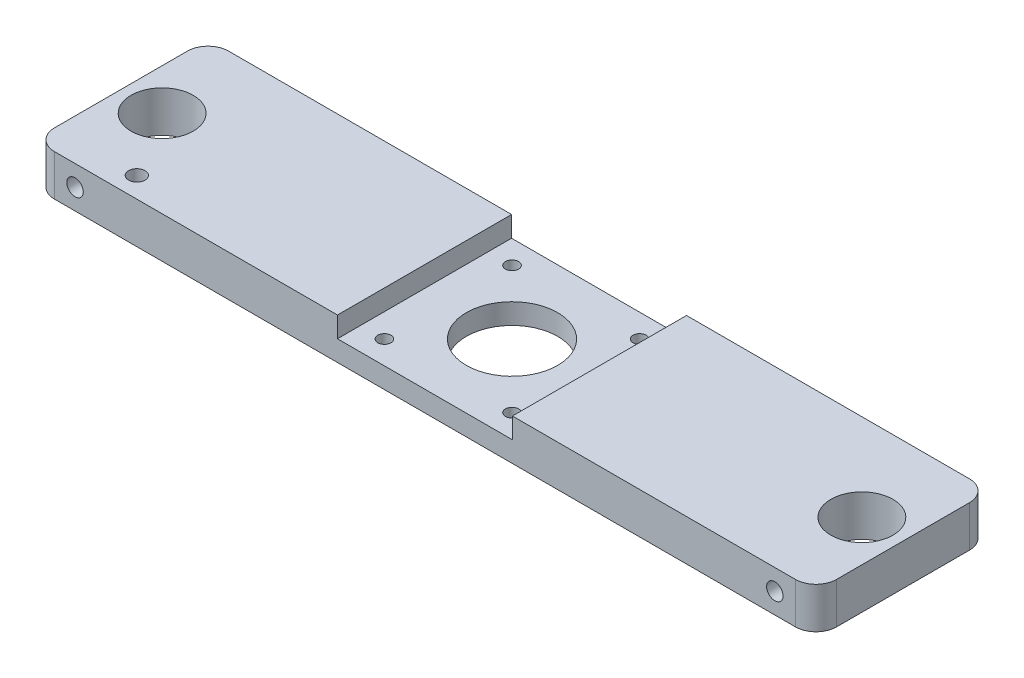
ISO-10303-21;
HEADER;
FILE_DESCRIPTION(('STEP AP214'),'2;1');
FILE_NAME('part.step','',(''),(''),'','','');
FILE_SCHEMA(('AUTOMOTIVE_DESIGN { 1 0 10303 214 1 1 1 1 }'));
ENDSEC;
DATA;
#1=APPLICATION_CONTEXT('core data for automotive mechanical design processes');
#2=APPLICATION_PROTOCOL_DEFINITION('international standard','automotive_design',2000,#1);
#3=PRODUCT_CONTEXT('',#1,'mechanical');
#4=PRODUCT('Part','Part','',(#3));
#5=PRODUCT_RELATED_PRODUCT_CATEGORY('part','',(#4));
#6=PRODUCT_DEFINITION_FORMATION('','',#4);
#7=PRODUCT_DEFINITION_CONTEXT('part definition',#1,'design');
#8=PRODUCT_DEFINITION('design','',#6,#7);
#9=PRODUCT_DEFINITION_SHAPE('','',#8);
#10=(LENGTH_UNIT() NAMED_UNIT(*) SI_UNIT(.MILLI.,.METRE.));
#11=(NAMED_UNIT(*) PLANE_ANGLE_UNIT() SI_UNIT($,.RADIAN.));
#12=(NAMED_UNIT(*) SI_UNIT($,.STERADIAN.) SOLID_ANGLE_UNIT());
#13=UNCERTAINTY_MEASURE_WITH_UNIT(LENGTH_MEASURE(1.E-05),#10,'distance_accuracy_value','');
#14=(GEOMETRIC_REPRESENTATION_CONTEXT(3) GLOBAL_UNCERTAINTY_ASSIGNED_CONTEXT((#13)) GLOBAL_UNIT_ASSIGNED_CONTEXT((#10,
#11,#12)) REPRESENTATION_CONTEXT('',''));
#15=CARTESIAN_POINT('',(0.,0.,0.));
#16=DIRECTION('',(0.,0.,1.));
#17=DIRECTION('',(1.,0.,0.));
#18=AXIS2_PLACEMENT_3D('',#15,#16,#17);
#19=CARTESIAN_POINT('',(0.,10.,0.));
#20=DIRECTION('',(0.,1.,0.));
#21=DIRECTION('',(0.,0.,1.));
#22=AXIS2_PLACEMENT_3D('',#19,#20,#21);
#23=PLANE('',#22);
#24=CARTESIAN_POINT('',(85.,10.,0.));
#25=DIRECTION('',(0.,1.,0.));
#26=DIRECTION('',(0.,0.,-1.));
#27=AXIS2_PLACEMENT_3D('',#24,#25,#26);
#28=CIRCLE('',#27,7.55);
#29=CARTESIAN_POINT('',(85.,10.,-7.55));
#30=VERTEX_POINT('',#29);
#31=EDGE_CURVE('E335',#30,#30,#28,.T.);
#32=ORIENTED_EDGE('',*,*,#31,.F.);
#33=EDGE_LOOP('',(#32));
#34=FACE_BOUND('',#33,.T.);
#35=DIRECTION('',(0.,0.,-1.));
#36=VECTOR('',#35,1.);
#37=CARTESIAN_POINT('',(95.,10.,-21.15));
#38=LINE('',#37,#36);
#39=CARTESIAN_POINT('',(95.,10.,16.15));
#40=VERTEX_POINT('',#39);
#41=CARTESIAN_POINT('',(95.,10.,-16.15));
#42=VERTEX_POINT('',#41);
#43=EDGE_CURVE('E178',#40,#42,#38,.T.);
#44=ORIENTED_EDGE('',*,*,#43,.T.);
#45=CARTESIAN_POINT('',(90.,10.,-16.15));
#46=DIRECTION('',(0.,1.,0.));
#47=DIRECTION('',(0.,0.,1.));
#48=AXIS2_PLACEMENT_3D('',#45,#46,#47);
#49=CIRCLE('',#48,5.);
#50=CARTESIAN_POINT('',(90.,10.,-21.15));
#51=VERTEX_POINT('',#50);
#52=EDGE_CURVE('E236',#42,#51,#49,.T.);
#53=ORIENTED_EDGE('',*,*,#52,.T.);
#54=DIRECTION('',(-1.,0.,0.));
#55=VECTOR('',#54,1.);
#56=CARTESIAN_POINT('',(-95.,10.,-21.15));
#57=LINE('',#56,#55);
#58=CARTESIAN_POINT('',(21.25,10.,-21.15));
#59=VERTEX_POINT('',#58);
#60=EDGE_CURVE('E184',#51,#59,#57,.T.);
#61=ORIENTED_EDGE('',*,*,#60,.T.);
#62=DIRECTION('',(0.,0.,-1.));
#63=VECTOR('',#62,1.);
#64=CARTESIAN_POINT('',(21.25,10.,0.));
#65=LINE('',#64,#63);
#66=CARTESIAN_POINT('',(21.25,10.,21.15));
#67=VERTEX_POINT('',#66);
#68=EDGE_CURVE('E150',#67,#59,#65,.T.);
#69=ORIENTED_EDGE('',*,*,#68,.F.);
#70=DIRECTION('',(1.,0.,0.));
#71=VECTOR('',#70,1.);
#72=CARTESIAN_POINT('',(-95.,10.,21.15));
#73=LINE('',#72,#71);
#74=CARTESIAN_POINT('',(90.,10.,21.15));
#75=VERTEX_POINT('',#74);
#76=EDGE_CURVE('E140',#67,#75,#73,.T.);
#77=ORIENTED_EDGE('',*,*,#76,.T.);
#78=CARTESIAN_POINT('',(90.,10.,16.15));
#79=DIRECTION('',(0.,1.,0.));
#80=DIRECTION('',(0.,0.,1.));
#81=AXIS2_PLACEMENT_3D('',#78,#79,#80);
#82=CIRCLE('',#81,5.);
#83=EDGE_CURVE('E233',#75,#40,#82,.T.);
#84=ORIENTED_EDGE('',*,*,#83,.T.);
#85=EDGE_LOOP('',(#44,#53,#61,#69,#77,#84));
#86=FACE_BOUND('',#85,.T.);
#87=ADVANCED_FACE('F40',(#34,#86),#23,.T.);
#88=CARTESIAN_POINT('',(95.,10.,-21.15));
#89=DIRECTION('',(-1.,0.,0.));
#90=DIRECTION('',(0.,0.,1.));
#91=AXIS2_PLACEMENT_3D('',#88,#89,#90);
#92=PLANE('',#91);
#93=DIRECTION('',(0.,0.,-1.));
#94=VECTOR('',#93,1.);
#95=CARTESIAN_POINT('',(95.,0.,-21.15));
#96=LINE('',#95,#94);
#97=CARTESIAN_POINT('',(95.,0.,16.15));
#98=VERTEX_POINT('',#97);
#99=CARTESIAN_POINT('',(95.,0.,-16.15));
#100=VERTEX_POINT('',#99);
#101=EDGE_CURVE('E177',#98,#100,#96,.T.);
#102=ORIENTED_EDGE('',*,*,#101,.T.);
#103=DIRECTION('',(0.,-1.,0.));
#104=VECTOR('',#103,1.);
#105=CARTESIAN_POINT('',(95.,10.,-16.15));
#106=LINE('',#105,#104);
#107=EDGE_CURVE('E230',#100,#42,#106,.F.);
#108=ORIENTED_EDGE('',*,*,#107,.T.);
#109=ORIENTED_EDGE('',*,*,#43,.F.);
#110=DIRECTION('',(0.,-1.,0.));
#111=VECTOR('',#110,1.);
#112=CARTESIAN_POINT('',(95.,10.,16.15));
#113=LINE('',#112,#111);
#114=EDGE_CURVE('E226',#40,#98,#113,.T.);
#115=ORIENTED_EDGE('',*,*,#114,.T.);
#116=EDGE_LOOP('',(#102,#108,#109,#115));
#117=FACE_BOUND('',#116,.T.);
#118=ADVANCED_FACE('F277',(#117),#92,.F.);
#119=CARTESIAN_POINT('',(-95.,10.,-21.15));
#120=DIRECTION('',(0.,0.,1.));
#121=DIRECTION('',(1.,0.,0.));
#122=AXIS2_PLACEMENT_3D('',#119,#120,#121);
#123=PLANE('',#122);
#124=ORIENTED_EDGE('',*,*,#60,.F.);
#125=DIRECTION('',(0.,-1.,0.));
#126=VECTOR('',#125,1.);
#127=CARTESIAN_POINT('',(90.,10.,-21.15));
#128=LINE('',#127,#126);
#129=CARTESIAN_POINT('',(90.,0.,-21.15));
#130=VERTEX_POINT('',#129);
#131=EDGE_CURVE('E210',#51,#130,#128,.T.);
#132=ORIENTED_EDGE('',*,*,#131,.T.);
#133=DIRECTION('',(-1.,0.,0.));
#134=VECTOR('',#133,1.);
#135=CARTESIAN_POINT('',(-95.,0.,-21.15));
#136=LINE('',#135,#134);
#137=CARTESIAN_POINT('',(-90.,0.,-21.15));
#138=VERTEX_POINT('',#137);
#139=EDGE_CURVE('E193',#130,#138,#136,.T.);
#140=ORIENTED_EDGE('',*,*,#139,.T.);
#141=DIRECTION('',(0.,-1.,0.));
#142=VECTOR('',#141,1.);
#143=CARTESIAN_POINT('',(-90.,10.,-21.15));
#144=LINE('',#143,#142);
#145=CARTESIAN_POINT('',(-90.,10.,-21.15));
#146=VERTEX_POINT('',#145);
#147=EDGE_CURVE('E207',#138,#146,#144,.F.);
#148=ORIENTED_EDGE('',*,*,#147,.T.);
#149=CARTESIAN_POINT('',(-21.25,10.,-21.15));
#150=VERTEX_POINT('',#149);
#151=EDGE_CURVE('E182',#150,#146,#57,.T.);
#152=ORIENTED_EDGE('',*,*,#151,.F.);
#153=DIRECTION('',(0.,-1.,0.));
#154=VECTOR('',#153,1.);
#155=CARTESIAN_POINT('',(-21.25,10.,-21.15));
#156=LINE('',#155,#154);
#157=CARTESIAN_POINT('',(-21.25,5.,-21.15));
#158=VERTEX_POINT('',#157);
#159=EDGE_CURVE('E148',#150,#158,#156,.T.);
#160=ORIENTED_EDGE('',*,*,#159,.T.);
#161=DIRECTION('',(-1.,0.,0.));
#162=VECTOR('',#161,1.);
#163=CARTESIAN_POINT('',(-95.,5.,-21.15));
#164=LINE('',#163,#162);
#165=CARTESIAN_POINT('',(21.25,5.,-21.15));
#166=VERTEX_POINT('',#165);
#167=EDGE_CURVE('E174',#166,#158,#164,.T.);
#168=ORIENTED_EDGE('',*,*,#167,.F.);
#169=DIRECTION('',(0.,1.,0.));
#170=VECTOR('',#169,1.);
#171=CARTESIAN_POINT('',(21.25,10.,-21.15));
#172=LINE('',#171,#170);
#173=EDGE_CURVE('E170',#166,#59,#172,.T.);
#174=ORIENTED_EDGE('',*,*,#173,.T.);
#175=EDGE_LOOP('',(#124,#132,#140,#148,#152,#160,#168,#174));
#176=FACE_BOUND('',#175,.T.);
#177=ADVANCED_FACE('F284',(#176),#123,.F.);
#178=CARTESIAN_POINT('',(-95.,10.,-21.15));
#179=DIRECTION('',(1.,0.,0.));
#180=DIRECTION('',(0.,0.,-1.));
#181=AXIS2_PLACEMENT_3D('',#178,#179,#180);
#182=PLANE('',#181);
#183=DIRECTION('',(0.,0.,1.));
#184=VECTOR('',#183,1.);
#185=CARTESIAN_POINT('',(-95.,0.,-21.15));
#186=LINE('',#185,#184);
#187=CARTESIAN_POINT('',(-95.,0.,-16.15));
#188=VERTEX_POINT('',#187);
#189=CARTESIAN_POINT('',(-95.,0.,16.15));
#190=VERTEX_POINT('',#189);
#191=EDGE_CURVE('E197',#188,#190,#186,.T.);
#192=ORIENTED_EDGE('',*,*,#191,.T.);
#193=DIRECTION('',(0.,-1.,0.));
#194=VECTOR('',#193,1.);
#195=CARTESIAN_POINT('',(-95.,10.,16.15));
#196=LINE('',#195,#194);
#197=CARTESIAN_POINT('',(-95.,10.,16.15));
#198=VERTEX_POINT('',#197);
#199=EDGE_CURVE('E56',#190,#198,#196,.F.);
#200=ORIENTED_EDGE('',*,*,#199,.T.);
#201=DIRECTION('',(0.,0.,1.));
#202=VECTOR('',#201,1.);
#203=CARTESIAN_POINT('',(-95.,10.,-21.15));
#204=LINE('',#203,#202);
#205=CARTESIAN_POINT('',(-95.,10.,-16.15));
#206=VERTEX_POINT('',#205);
#207=EDGE_CURVE('E187',#206,#198,#204,.T.);
#208=ORIENTED_EDGE('',*,*,#207,.F.);
#209=DIRECTION('',(0.,-1.,0.));
#210=VECTOR('',#209,1.);
#211=CARTESIAN_POINT('',(-95.,10.,-16.15));
#212=LINE('',#211,#210);
#213=EDGE_CURVE('E245',#206,#188,#212,.T.);
#214=ORIENTED_EDGE('',*,*,#213,.T.);
#215=EDGE_LOOP('',(#192,#200,#208,#214));
#216=FACE_BOUND('',#215,.T.);
#217=ADVANCED_FACE('F259',(#216),#182,.F.);
#218=CARTESIAN_POINT('',(-95.,10.,21.15));
#219=DIRECTION('',(0.,0.,-1.));
#220=DIRECTION('',(-1.,0.,0.));
#221=AXIS2_PLACEMENT_3D('',#218,#219,#220);
#222=PLANE('',#221);
#223=CARTESIAN_POINT('',(85.,5.,21.15));
#224=DIRECTION('',(0.,0.,1.));
#225=DIRECTION('',(1.,0.,0.));
#226=AXIS2_PLACEMENT_3D('',#223,#224,#225);
#227=CIRCLE('',#226,2.);
#228=CARTESIAN_POINT('',(87.,5.,21.15));
#229=VERTEX_POINT('',#228);
#230=EDGE_CURVE('E340',#229,#229,#227,.T.);
#231=ORIENTED_EDGE('',*,*,#230,.F.);
#232=EDGE_LOOP('',(#231));
#233=FACE_BOUND('',#232,.T.);
#234=CARTESIAN_POINT('',(-85.,5.,21.15));
#235=DIRECTION('',(0.,0.,1.));
#236=DIRECTION('',(1.,0.,0.));
#237=AXIS2_PLACEMENT_3D('',#234,#235,#236);
#238=CIRCLE('',#237,2.);
#239=CARTESIAN_POINT('',(-83.,5.,21.15));
#240=VERTEX_POINT('',#239);
#241=EDGE_CURVE('E351',#240,#240,#238,.T.);
#242=ORIENTED_EDGE('',*,*,#241,.F.);
#243=EDGE_LOOP('',(#242));
#244=FACE_BOUND('',#243,.T.);
#245=DIRECTION('',(1.,0.,0.));
#246=VECTOR('',#245,1.);
#247=CARTESIAN_POINT('',(-95.,0.,21.15));
#248=LINE('',#247,#246);
#249=CARTESIAN_POINT('',(-90.,0.,21.15));
#250=VERTEX_POINT('',#249);
#251=CARTESIAN_POINT('',(90.,0.,21.15));
#252=VERTEX_POINT('',#251);
#253=EDGE_CURVE('E183',#250,#252,#248,.T.);
#254=ORIENTED_EDGE('',*,*,#253,.T.);
#255=DIRECTION('',(0.,-1.,0.));
#256=VECTOR('',#255,1.);
#257=CARTESIAN_POINT('',(90.,10.,21.15));
#258=LINE('',#257,#256);
#259=EDGE_CURVE('E242',#252,#75,#258,.F.);
#260=ORIENTED_EDGE('',*,*,#259,.T.);
#261=ORIENTED_EDGE('',*,*,#76,.F.);
#262=DIRECTION('',(0.,-1.,0.));
#263=VECTOR('',#262,1.);
#264=CARTESIAN_POINT('',(21.25,10.,21.15));
#265=LINE('',#264,#263);
#266=CARTESIAN_POINT('',(21.25,5.,21.15));
#267=VERTEX_POINT('',#266);
#268=EDGE_CURVE('E162',#67,#267,#265,.T.);
#269=ORIENTED_EDGE('',*,*,#268,.T.);
#270=DIRECTION('',(1.,0.,0.));
#271=VECTOR('',#270,1.);
#272=CARTESIAN_POINT('',(-95.,5.,21.15));
#273=LINE('',#272,#271);
#274=CARTESIAN_POINT('',(-21.25,5.,21.15));
#275=VERTEX_POINT('',#274);
#276=EDGE_CURVE('E156',#275,#267,#273,.T.);
#277=ORIENTED_EDGE('',*,*,#276,.F.);
#278=DIRECTION('',(0.,1.,0.));
#279=VECTOR('',#278,1.);
#280=CARTESIAN_POINT('',(-21.25,10.,21.15));
#281=LINE('',#280,#279);
#282=CARTESIAN_POINT('',(-21.25,10.,21.15));
#283=VERTEX_POINT('',#282);
#284=EDGE_CURVE('E145',#275,#283,#281,.T.);
#285=ORIENTED_EDGE('',*,*,#284,.T.);
#286=CARTESIAN_POINT('',(-90.,10.,21.15));
#287=VERTEX_POINT('',#286);
#288=EDGE_CURVE('E129',#287,#283,#73,.T.);
#289=ORIENTED_EDGE('',*,*,#288,.F.);
#290=DIRECTION('',(0.,-1.,0.));
#291=VECTOR('',#290,1.);
#292=CARTESIAN_POINT('',(-90.,10.,21.15));
#293=LINE('',#292,#291);
#294=EDGE_CURVE('E239',#287,#250,#293,.T.);
#295=ORIENTED_EDGE('',*,*,#294,.T.);
#296=EDGE_LOOP('',(#254,#260,#261,#269,#277,#285,#289,#295));
#297=FACE_BOUND('',#296,.T.);
#298=ADVANCED_FACE('F154',(#233,#244,#297),#222,.F.);
#299=CARTESIAN_POINT('',(-75.,10.,16.15));
#300=DIRECTION('',(0.,1.,0.));
#301=DIRECTION('',(0.,0.,1.));
#302=AXIS2_PLACEMENT_3D('',#299,#300,#301);
#303=CIRCLE('',#302,2.);
#304=CARTESIAN_POINT('',(-75.,10.,18.15));
#305=VERTEX_POINT('',#304);
#306=EDGE_CURVE('E386',#305,#305,#303,.T.);
#307=ORIENTED_EDGE('',*,*,#306,.F.);
#308=EDGE_LOOP('',(#307));
#309=FACE_BOUND('',#308,.T.);
#310=CARTESIAN_POINT('',(-85.,10.,0.));
#311=DIRECTION('',(0.,1.,0.));
#312=DIRECTION('',(0.,0.,1.));
#313=AXIS2_PLACEMENT_3D('',#310,#311,#312);
#314=CIRCLE('',#313,7.55);
#315=CARTESIAN_POINT('',(-85.,10.,7.55));
#316=VERTEX_POINT('',#315);
#317=EDGE_CURVE('E344',#316,#316,#314,.T.);
#318=ORIENTED_EDGE('',*,*,#317,.F.);
#319=EDGE_LOOP('',(#318));
#320=FACE_BOUND('',#319,.T.);
#321=ORIENTED_EDGE('',*,*,#207,.T.);
#322=CARTESIAN_POINT('',(-90.,10.,16.15));
#323=DIRECTION('',(0.,1.,0.));
#324=DIRECTION('',(0.,0.,1.));
#325=AXIS2_PLACEMENT_3D('',#322,#323,#324);
#326=CIRCLE('',#325,5.);
#327=EDGE_CURVE('E11',#198,#287,#326,.T.);
#328=ORIENTED_EDGE('',*,*,#327,.T.);
#329=ORIENTED_EDGE('',*,*,#288,.T.);
#330=DIRECTION('',(0.,0.,1.));
#331=VECTOR('',#330,1.);
#332=CARTESIAN_POINT('',(-21.25,10.,0.));
#333=LINE('',#332,#331);
#334=EDGE_CURVE('E132',#150,#283,#333,.T.);
#335=ORIENTED_EDGE('',*,*,#334,.F.);
#336=ORIENTED_EDGE('',*,*,#151,.T.);
#337=CARTESIAN_POINT('',(-90.,10.,-16.15));
#338=DIRECTION('',(0.,1.,0.));
#339=DIRECTION('',(0.,0.,1.));
#340=AXIS2_PLACEMENT_3D('',#337,#338,#339);
#341=CIRCLE('',#340,5.);
#342=EDGE_CURVE('E49',#146,#206,#341,.T.);
#343=ORIENTED_EDGE('',*,*,#342,.T.);
#344=EDGE_LOOP('',(#321,#328,#329,#335,#336,#343));
#345=FACE_BOUND('',#344,.T.);
#346=ADVANCED_FACE('F131',(#309,#320,#345),#23,.T.);
#347=CARTESIAN_POINT('',(0.,0.,0.));
#348=DIRECTION('',(0.,1.,0.));
#349=DIRECTION('',(0.,0.,1.));
#350=AXIS2_PLACEMENT_3D('',#347,#348,#349);
#351=PLANE('',#350);
#352=CARTESIAN_POINT('',(-75.,0.,16.15));
#353=DIRECTION('',(0.,1.,0.));
#354=DIRECTION('',(0.,0.,1.));
#355=AXIS2_PLACEMENT_3D('',#352,#353,#354);
#356=CIRCLE('',#355,2.);
#357=CARTESIAN_POINT('',(-75.,0.,18.15));
#358=VERTEX_POINT('',#357);
#359=EDGE_CURVE('E365',#358,#358,#356,.T.);
#360=ORIENTED_EDGE('',*,*,#359,.T.);
#361=EDGE_LOOP('',(#360));
#362=FACE_BOUND('',#361,.T.);
#363=CARTESIAN_POINT('',(-85.,0.,0.));
#364=DIRECTION('',(0.,1.,0.));
#365=DIRECTION('',(0.,0.,1.));
#366=AXIS2_PLACEMENT_3D('',#363,#364,#365);
#367=CIRCLE('',#366,7.55);
#368=CARTESIAN_POINT('',(-85.,0.,7.55));
#369=VERTEX_POINT('',#368);
#370=EDGE_CURVE('E308',#369,#369,#367,.T.);
#371=ORIENTED_EDGE('',*,*,#370,.T.);
#372=EDGE_LOOP('',(#371));
#373=FACE_BOUND('',#372,.T.);
#374=CARTESIAN_POINT('',(85.,0.,0.));
#375=DIRECTION('',(0.,1.,0.));
#376=DIRECTION('',(0.,0.,-1.));
#377=AXIS2_PLACEMENT_3D('',#374,#375,#376);
#378=CIRCLE('',#377,7.55);
#379=CARTESIAN_POINT('',(85.,0.,-7.55));
#380=VERTEX_POINT('',#379);
#381=EDGE_CURVE('E339',#380,#380,#378,.T.);
#382=ORIENTED_EDGE('',*,*,#381,.T.);
#383=EDGE_LOOP('',(#382));
#384=FACE_BOUND('',#383,.T.);
#385=CARTESIAN_POINT('',(0.,0.,0.));
#386=DIRECTION('',(0.,1.,0.));
#387=DIRECTION('',(0.,0.,1.));
#388=AXIS2_PLACEMENT_3D('',#385,#386,#387);
#389=CIRCLE('',#388,11.1);
#390=CARTESIAN_POINT('',(0.,0.,11.1));
#391=VERTEX_POINT('',#390);
#392=EDGE_CURVE('E307',#391,#391,#389,.T.);
#393=ORIENTED_EDGE('',*,*,#392,.T.);
#394=EDGE_LOOP('',(#393));
#395=FACE_BOUND('',#394,.T.);
#396=CARTESIAN_POINT('',(-15.5,0.,15.5));
#397=DIRECTION('',(0.,1.,0.));
#398=DIRECTION('',(0.,0.,-1.));
#399=AXIS2_PLACEMENT_3D('',#396,#397,#398);
#400=CIRCLE('',#399,1.6);
#401=CARTESIAN_POINT('',(-15.5,0.,13.9));
#402=VERTEX_POINT('',#401);
#403=EDGE_CURVE('E316',#402,#402,#400,.T.);
#404=ORIENTED_EDGE('',*,*,#403,.T.);
#405=EDGE_LOOP('',(#404));
#406=FACE_BOUND('',#405,.T.);
#407=CARTESIAN_POINT('',(15.5,0.,15.5));
#408=DIRECTION('',(0.,1.,0.));
#409=DIRECTION('',(0.,0.,1.));
#410=AXIS2_PLACEMENT_3D('',#407,#408,#409);
#411=CIRCLE('',#410,1.6);
#412=CARTESIAN_POINT('',(15.5,0.,17.1));
#413=VERTEX_POINT('',#412);
#414=EDGE_CURVE('E324',#413,#413,#411,.T.);
#415=ORIENTED_EDGE('',*,*,#414,.T.);
#416=EDGE_LOOP('',(#415));
#417=FACE_BOUND('',#416,.T.);
#418=CARTESIAN_POINT('',(15.5,0.,-15.5));
#419=DIRECTION('',(0.,1.,0.));
#420=DIRECTION('',(0.,0.,-1.));
#421=AXIS2_PLACEMENT_3D('',#418,#419,#420);
#422=CIRCLE('',#421,1.6);
#423=CARTESIAN_POINT('',(15.5,0.,-17.1));
#424=VERTEX_POINT('',#423);
#425=EDGE_CURVE('E301',#424,#424,#422,.T.);
#426=ORIENTED_EDGE('',*,*,#425,.T.);
#427=EDGE_LOOP('',(#426));
#428=FACE_BOUND('',#427,.T.);
#429=CARTESIAN_POINT('',(-15.5,0.,-15.5));
#430=DIRECTION('',(0.,1.,0.));
#431=DIRECTION('',(0.,0.,1.));
#432=AXIS2_PLACEMENT_3D('',#429,#430,#431);
#433=CIRCLE('',#432,1.6);
#434=CARTESIAN_POINT('',(-15.5,0.,-13.9));
#435=VERTEX_POINT('',#434);
#436=EDGE_CURVE('E293',#435,#435,#433,.T.);
#437=ORIENTED_EDGE('',*,*,#436,.T.);
#438=EDGE_LOOP('',(#437));
#439=FACE_BOUND('',#438,.T.);
#440=ORIENTED_EDGE('',*,*,#139,.F.);
#441=CARTESIAN_POINT('',(90.,0.,-16.15));
#442=DIRECTION('',(0.,1.,0.));
#443=DIRECTION('',(0.,0.,1.));
#444=AXIS2_PLACEMENT_3D('',#441,#442,#443);
#445=CIRCLE('',#444,5.);
#446=EDGE_CURVE('E223',#130,#100,#445,.F.);
#447=ORIENTED_EDGE('',*,*,#446,.T.);
#448=ORIENTED_EDGE('',*,*,#101,.F.);
#449=CARTESIAN_POINT('',(90.,0.,16.15));
#450=DIRECTION('',(0.,1.,0.));
#451=DIRECTION('',(0.,0.,1.));
#452=AXIS2_PLACEMENT_3D('',#449,#450,#451);
#453=CIRCLE('',#452,5.);
#454=EDGE_CURVE('E220',#98,#252,#453,.F.);
#455=ORIENTED_EDGE('',*,*,#454,.T.);
#456=ORIENTED_EDGE('',*,*,#253,.F.);
#457=CARTESIAN_POINT('',(-90.,0.,16.15));
#458=DIRECTION('',(0.,1.,0.));
#459=DIRECTION('',(0.,0.,1.));
#460=AXIS2_PLACEMENT_3D('',#457,#458,#459);
#461=CIRCLE('',#460,5.);
#462=EDGE_CURVE('E217',#250,#190,#461,.F.);
#463=ORIENTED_EDGE('',*,*,#462,.T.);
#464=ORIENTED_EDGE('',*,*,#191,.F.);
#465=CARTESIAN_POINT('',(-90.,0.,-16.15));
#466=DIRECTION('',(0.,1.,0.));
#467=DIRECTION('',(0.,0.,1.));
#468=AXIS2_PLACEMENT_3D('',#465,#466,#467);
#469=CIRCLE('',#468,5.);
#470=EDGE_CURVE('E214',#188,#138,#469,.F.);
#471=ORIENTED_EDGE('',*,*,#470,.T.);
#472=EDGE_LOOP('',(#440,#447,#448,#455,#456,#463,#464,#471));
#473=FACE_BOUND('',#472,.T.);
#474=ADVANCED_FACE('F262',(#362,#373,#384,#395,#406,#417,#428,#439,#473),#351,.F.);
#475=CARTESIAN_POINT('',(0.,5.,0.));
#476=DIRECTION('',(0.,1.,0.));
#477=DIRECTION('',(0.,0.,1.));
#478=AXIS2_PLACEMENT_3D('',#475,#476,#477);
#479=PLANE('',#478);
#480=CARTESIAN_POINT('',(0.,5.,0.));
#481=DIRECTION('',(0.,1.,0.));
#482=DIRECTION('',(0.,0.,1.));
#483=AXIS2_PLACEMENT_3D('',#480,#481,#482);
#484=CIRCLE('',#483,11.1);
#485=CARTESIAN_POINT('',(0.,5.,11.1));
#486=VERTEX_POINT('',#485);
#487=EDGE_CURVE('E303',#486,#486,#484,.T.);
#488=ORIENTED_EDGE('',*,*,#487,.F.);
#489=EDGE_LOOP('',(#488));
#490=FACE_BOUND('',#489,.T.);
#491=CARTESIAN_POINT('',(-15.5,5.,15.5));
#492=DIRECTION('',(0.,1.,0.));
#493=DIRECTION('',(0.,0.,-1.));
#494=AXIS2_PLACEMENT_3D('',#491,#492,#493);
#495=CIRCLE('',#494,1.6);
#496=CARTESIAN_POINT('',(-15.5,5.,13.9));
#497=VERTEX_POINT('',#496);
#498=EDGE_CURVE('E312',#497,#497,#495,.T.);
#499=ORIENTED_EDGE('',*,*,#498,.F.);
#500=EDGE_LOOP('',(#499));
#501=FACE_BOUND('',#500,.T.);
#502=CARTESIAN_POINT('',(15.5,5.,15.5));
#503=DIRECTION('',(0.,1.,0.));
#504=DIRECTION('',(0.,0.,1.));
#505=AXIS2_PLACEMENT_3D('',#502,#503,#504);
#506=CIRCLE('',#505,1.6);
#507=CARTESIAN_POINT('',(15.5,5.,17.1));
#508=VERTEX_POINT('',#507);
#509=EDGE_CURVE('E320',#508,#508,#506,.T.);
#510=ORIENTED_EDGE('',*,*,#509,.F.);
#511=EDGE_LOOP('',(#510));
#512=FACE_BOUND('',#511,.T.);
#513=CARTESIAN_POINT('',(15.5,5.,-15.5));
#514=DIRECTION('',(0.,1.,0.));
#515=DIRECTION('',(0.,0.,-1.));
#516=AXIS2_PLACEMENT_3D('',#513,#514,#515);
#517=CIRCLE('',#516,1.6);
#518=CARTESIAN_POINT('',(15.5,5.,-17.1));
#519=VERTEX_POINT('',#518);
#520=EDGE_CURVE('E328',#519,#519,#517,.T.);
#521=ORIENTED_EDGE('',*,*,#520,.F.);
#522=EDGE_LOOP('',(#521));
#523=FACE_BOUND('',#522,.T.);
#524=CARTESIAN_POINT('',(-15.5,5.,-15.5));
#525=DIRECTION('',(0.,1.,0.));
#526=DIRECTION('',(0.,0.,1.));
#527=AXIS2_PLACEMENT_3D('',#524,#525,#526);
#528=CIRCLE('',#527,1.6);
#529=CARTESIAN_POINT('',(-15.5,5.,-13.9));
#530=VERTEX_POINT('',#529);
#531=EDGE_CURVE('E296',#530,#530,#528,.T.);
#532=ORIENTED_EDGE('',*,*,#531,.F.);
#533=EDGE_LOOP('',(#532));
#534=FACE_BOUND('',#533,.T.);
#535=ORIENTED_EDGE('',*,*,#167,.T.);
#536=DIRECTION('',(0.,0.,1.));
#537=VECTOR('',#536,1.);
#538=CARTESIAN_POINT('',(-21.25,5.,-38.5265278249642));
#539=LINE('',#538,#537);
#540=EDGE_CURVE('E158',#158,#275,#539,.T.);
#541=ORIENTED_EDGE('',*,*,#540,.T.);
#542=ORIENTED_EDGE('',*,*,#276,.T.);
#543=DIRECTION('',(0.,0.,-1.));
#544=VECTOR('',#543,1.);
#545=CARTESIAN_POINT('',(21.25,5.,-38.5265278249642));
#546=LINE('',#545,#544);
#547=EDGE_CURVE('E164',#267,#166,#546,.T.);
#548=ORIENTED_EDGE('',*,*,#547,.T.);
#549=EDGE_LOOP('',(#535,#541,#542,#548));
#550=FACE_BOUND('',#549,.T.);
#551=ADVANCED_FACE('F291',(#490,#501,#512,#523,#534,#550),#479,.T.);
#552=CARTESIAN_POINT('',(21.25,5.,-38.5265278249642));
#553=DIRECTION('',(1.,0.,0.));
#554=DIRECTION('',(0.,0.,-1.));
#555=AXIS2_PLACEMENT_3D('',#552,#553,#554);
#556=PLANE('',#555);
#557=ORIENTED_EDGE('',*,*,#547,.F.);
#558=ORIENTED_EDGE('',*,*,#268,.F.);
#559=ORIENTED_EDGE('',*,*,#68,.T.);
#560=ORIENTED_EDGE('',*,*,#173,.F.);
#561=EDGE_LOOP('',(#557,#558,#559,#560));
#562=FACE_BOUND('',#561,.T.);
#563=ADVANCED_FACE('F289',(#562),#556,.F.);
#564=CARTESIAN_POINT('',(-21.25,5.,-38.5265278249642));
#565=DIRECTION('',(-1.,0.,0.));
#566=DIRECTION('',(0.,0.,1.));
#567=AXIS2_PLACEMENT_3D('',#564,#565,#566);
#568=PLANE('',#567);
#569=ORIENTED_EDGE('',*,*,#334,.T.);
#570=ORIENTED_EDGE('',*,*,#284,.F.);
#571=ORIENTED_EDGE('',*,*,#540,.F.);
#572=ORIENTED_EDGE('',*,*,#159,.F.);
#573=EDGE_LOOP('',(#569,#570,#571,#572));
#574=FACE_BOUND('',#573,.T.);
#575=ADVANCED_FACE('F143',(#574),#568,.F.);
#576=CARTESIAN_POINT('',(-15.5,0.,-15.5));
#577=DIRECTION('',(0.,1.,0.));
#578=DIRECTION('',(0.,0.,1.));
#579=AXIS2_PLACEMENT_3D('',#576,#577,#578);
#580=CYLINDRICAL_SURFACE('',#579,1.6);
#581=ORIENTED_EDGE('',*,*,#436,.F.);
#582=EDGE_LOOP('',(#581));
#583=FACE_BOUND('',#582,.T.);
#584=ORIENTED_EDGE('',*,*,#531,.T.);
#585=EDGE_LOOP('',(#584));
#586=FACE_BOUND('',#585,.T.);
#587=ADVANCED_FACE('F536',(#583,#586),#580,.F.);
#588=CARTESIAN_POINT('',(15.5,0.,-15.5));
#589=DIRECTION('',(0.,1.,0.));
#590=DIRECTION('',(0.,0.,1.));
#591=AXIS2_PLACEMENT_3D('',#588,#589,#590);
#592=CYLINDRICAL_SURFACE('',#591,1.6);
#593=ORIENTED_EDGE('',*,*,#425,.F.);
#594=EDGE_LOOP('',(#593));
#595=FACE_BOUND('',#594,.T.);
#596=ORIENTED_EDGE('',*,*,#520,.T.);
#597=EDGE_LOOP('',(#596));
#598=FACE_BOUND('',#597,.T.);
#599=ADVANCED_FACE('F526',(#595,#598),#592,.F.);
#600=CARTESIAN_POINT('',(15.5,0.,15.5));
#601=DIRECTION('',(0.,1.,0.));
#602=DIRECTION('',(0.,0.,1.));
#603=AXIS2_PLACEMENT_3D('',#600,#601,#602);
#604=CYLINDRICAL_SURFACE('',#603,1.6);
#605=ORIENTED_EDGE('',*,*,#414,.F.);
#606=EDGE_LOOP('',(#605));
#607=FACE_BOUND('',#606,.T.);
#608=ORIENTED_EDGE('',*,*,#509,.T.);
#609=EDGE_LOOP('',(#608));
#610=FACE_BOUND('',#609,.T.);
#611=ADVANCED_FACE('F516',(#607,#610),#604,.F.);
#612=CARTESIAN_POINT('',(-15.5,0.,15.5));
#613=DIRECTION('',(0.,1.,0.));
#614=DIRECTION('',(0.,0.,1.));
#615=AXIS2_PLACEMENT_3D('',#612,#613,#614);
#616=CYLINDRICAL_SURFACE('',#615,1.6);
#617=ORIENTED_EDGE('',*,*,#403,.F.);
#618=EDGE_LOOP('',(#617));
#619=FACE_BOUND('',#618,.T.);
#620=ORIENTED_EDGE('',*,*,#498,.T.);
#621=EDGE_LOOP('',(#620));
#622=FACE_BOUND('',#621,.T.);
#623=ADVANCED_FACE('F505',(#619,#622),#616,.F.);
#624=CARTESIAN_POINT('',(0.,0.,0.));
#625=DIRECTION('',(0.,1.,0.));
#626=DIRECTION('',(0.,0.,1.));
#627=AXIS2_PLACEMENT_3D('',#624,#625,#626);
#628=CYLINDRICAL_SURFACE('',#627,11.1);
#629=ORIENTED_EDGE('',*,*,#392,.F.);
#630=EDGE_LOOP('',(#629));
#631=FACE_BOUND('',#630,.T.);
#632=ORIENTED_EDGE('',*,*,#487,.T.);
#633=EDGE_LOOP('',(#632));
#634=FACE_BOUND('',#633,.T.);
#635=ADVANCED_FACE('F414',(#631,#634),#628,.F.);
#636=CARTESIAN_POINT('',(85.,0.,0.));
#637=DIRECTION('',(0.,1.,0.));
#638=DIRECTION('',(0.,0.,1.));
#639=AXIS2_PLACEMENT_3D('',#636,#637,#638);
#640=CYLINDRICAL_SURFACE('',#639,7.55);
#641=CARTESIAN_POINT('',(87.,5.,7.28028158796073));
#642=CARTESIAN_POINT('',(86.9999972876549,4.88979517369675,7.28028352370104));
#643=CARTESIAN_POINT('',(86.9908601408073,4.77956150154601,7.28281126792323));
#644=CARTESIAN_POINT('',(86.9546210486567,4.56227575635664,7.29261936624848));
#645=CARTESIAN_POINT('',(86.9275099350568,4.4552253361879,7.29990214580715));
#646=CARTESIAN_POINT('',(86.8562750167029,4.24748076503464,7.31833890674222));
#647=CARTESIAN_POINT('',(86.8121749188902,4.14677798321486,7.32948749150133));
#648=CARTESIAN_POINT('',(86.708287917892,3.95418504621734,7.35439283404707));
#649=CARTESIAN_POINT('',(86.6484998552782,3.8622955430759,7.36814978458566));
#650=CARTESIAN_POINT('',(86.5133561400013,3.68766924311591,7.39710227699219));
#651=CARTESIAN_POINT('',(86.4376831102069,3.60518219795507,7.41232305517532));
#652=CARTESIAN_POINT('',(86.2736002230129,3.45390932211298,7.44227026429459));
#653=CARTESIAN_POINT('',(86.1851890612555,3.38512489627166,7.45699664441478));
#654=CARTESIAN_POINT('',(85.9964100465284,3.2621704754933,7.48457713841675));
#655=CARTESIAN_POINT('',(85.8958754070919,3.20824845311675,7.49739800906828));
#656=CARTESIAN_POINT('',(85.6867712115948,3.11816614808294,7.51943353720039));
#657=CARTESIAN_POINT('',(85.5782029953019,3.08200291142261,7.5286487943882));
#658=CARTESIAN_POINT('',(85.3587200441394,3.02927211878625,7.54225634479849));
#659=CARTESIAN_POINT('',(85.2479139443296,3.01227979631989,7.54675302218234));
#660=CARTESIAN_POINT('',(85.0249386743121,2.99703712306116,7.5507815928245));
#661=CARTESIAN_POINT('',(84.9127697324068,2.99878367523215,7.55031430649385));
#662=CARTESIAN_POINT('',(84.6932082437668,3.02066935740798,7.54454421453287));
#663=CARTESIAN_POINT('',(84.5857663027542,3.04034960999715,7.53936205555679));
#664=CARTESIAN_POINT('',(84.3757680323627,3.09680311588696,7.52488665007111));
#665=CARTESIAN_POINT('',(84.2732119800588,3.13357733730422,7.51559317071839));
#666=CARTESIAN_POINT('',(84.0747211687762,3.22352871705243,7.49375978902994));
#667=CARTESIAN_POINT('',(83.978861514851,3.27686375856979,7.4811888341239));
#668=CARTESIAN_POINT('',(83.7972959307247,3.39830176509326,7.4541559660416));
#669=CARTESIAN_POINT('',(83.7115919618982,3.46640757562322,7.4396936887238));
#670=CARTESIAN_POINT('',(83.5500318539781,3.61789239161323,7.40992928509999));
#671=CARTESIAN_POINT('',(83.4745528670323,3.70167170611571,7.39461498923414));
#672=CARTESIAN_POINT('',(83.3386249334709,3.88085765935046,7.3652686238972));
#673=CARTESIAN_POINT('',(83.2781768784671,3.97626498733867,7.35123663052154));
#674=CARTESIAN_POINT('',(83.1737446155736,4.17680801663409,7.32599536954343));
#675=CARTESIAN_POINT('',(83.1298616309608,4.28199878534898,7.31480358939822));
#676=CARTESIAN_POINT('',(83.0605259901042,4.4986351802624,7.29672793729606));
#677=CARTESIAN_POINT('',(83.0350688325916,4.6100792716558,7.28984301326758));
#678=CARTESIAN_POINT('',(83.0039550024314,4.83253482797256,7.28138438629999));
#679=CARTESIAN_POINT('',(82.9977362686058,4.94346203725969,7.27965996687949));
#680=CARTESIAN_POINT('',(83.003728300976,5.16477110103213,7.28130546854451));
#681=CARTESIAN_POINT('',(83.0159371351763,5.27515301147078,7.28467485558178));
#682=CARTESIAN_POINT('',(83.0579425245433,5.49008110620946,7.29598286838887));
#683=CARTESIAN_POINT('',(83.0874023649505,5.5946981512078,7.30383394609329));
#684=CARTESIAN_POINT('',(83.1626954870507,5.79750653254336,7.32313545610419));
#685=CARTESIAN_POINT('',(83.2085308859541,5.89569703604413,7.33458635381158));
#686=CARTESIAN_POINT('',(83.3164189406513,6.08521987721546,7.36010749170985));
#687=CARTESIAN_POINT('',(83.3788023064125,6.17635685952512,7.37422923603976));
#688=CARTESIAN_POINT('',(83.517604630004,6.34707534626712,7.4033791663364));
#689=CARTESIAN_POINT('',(83.5940261901297,6.42665470332776,7.41840752001614));
#690=CARTESIAN_POINT('',(83.761333151265,6.57432603684841,7.4481953427356));
#691=CARTESIAN_POINT('',(83.852568439363,6.64202639502026,7.46293497060296));
#692=CARTESIAN_POINT('',(84.0454352087172,6.76115025876055,7.49004504478181));
#693=CARTESIAN_POINT('',(84.1470661366123,6.81257463010552,7.5024156170978));
#694=CARTESIAN_POINT('',(84.3571243868583,6.8972171158125,7.52331414297651));
#695=CARTESIAN_POINT('',(84.4654941312781,6.93057074261164,7.53187061006985));
#696=CARTESIAN_POINT('',(84.6865604270933,6.97851975657,7.54430226423635));
#697=CARTESIAN_POINT('',(84.7992560276897,6.99311924174611,7.54817847399374));
#698=CARTESIAN_POINT('',(85.0221141694164,7.00289163842117,7.55076528849755));
#699=CARTESIAN_POINT('',(85.132250089502,6.99863937436393,7.54962874676902));
#700=CARTESIAN_POINT('',(85.3501800283781,6.97216170116553,7.54266270223578));
#701=CARTESIAN_POINT('',(85.4579741328877,6.94993695102523,7.53683337150256));
#702=CARTESIAN_POINT('',(85.6674788379972,6.8884684603622,7.52116636150732));
#703=CARTESIAN_POINT('',(85.7692254220825,6.84933997956657,7.51135585527319));
#704=CARTESIAN_POINT('',(85.964767313273,6.7552777803271,7.48875311764241));
#705=CARTESIAN_POINT('',(86.0585615144165,6.70034186814914,7.47596047243532));
#706=CARTESIAN_POINT('',(86.23821776007,6.57453417753799,7.44834222553129));
#707=CARTESIAN_POINT('',(86.323805341849,6.50328030117955,7.43347190315885));
#708=CARTESIAN_POINT('',(86.4820032894406,6.347585870033,7.40355737942109));
#709=CARTESIAN_POINT('',(86.5546102489534,6.26314186482815,7.38851313351522));
#710=CARTESIAN_POINT('',(86.6863387003506,6.08126757773358,7.35958004751228));
#711=CARTESIAN_POINT('',(86.7451346920609,5.98359600030555,7.34572321999898));
#712=CARTESIAN_POINT('',(86.8453872706232,5.77939919413181,7.32118347534014));
#713=CARTESIAN_POINT('',(86.8868553399327,5.67287988467958,7.3104984577387));
#714=CARTESIAN_POINT('',(86.9457646749153,5.47227516933535,7.29501614469776));
#715=CARTESIAN_POINT('',(86.9660555500642,5.37906962413479,7.2895350447098));
#716=CARTESIAN_POINT('',(86.9931736408713,5.19058308945727,7.2821671281095));
#717=CARTESIAN_POINT('',(87.000002345567,5.0953023306965,7.28027991398174));
#718=CARTESIAN_POINT('',(87.,5.,7.28028158796073));
#719=B_SPLINE_CURVE_WITH_KNOTS('',3,(#641,#642,#643,#644,#645,#646,#647,#648,#649,#650,#651,
#652,#653,#654,#655,#656,#657,#658,#659,#660,#661,#662,#663,#664,#665,#666,#667,#668,#669,#670,
#671,#672,#673,#674,#675,#676,#677,#678,#679,#680,#681,#682,#683,#684,#685,#686,#687,#688,#689,
#690,#691,#692,#693,#694,#695,#696,#697,#698,#699,#700,#701,#702,#703,#704,#705,#706,#707,#708,
#709,#710,#711,#712,#713,#714,#715,#716,#717,#718),.UNSPECIFIED.,.T.,.F.,(4,2,2,2,2,2,2,2,2,2,2,
2,2,2,2,2,2,2,2,2,2,2,2,2,2,2,2,2,2,2,2,2,2,2,2,2,2,2,4),(0.,0.330264088526647,
0.660696770406517,0.990670017062406,1.32066765745924,1.65802301435996,1.99541294031916,
2.33813148084937,2.68079299412247,3.01570320567511,3.350558066347,3.67707831446076,
4.00361705729637,4.33336975303098,4.6631860306922,5.00299747266091,5.3428290669168,
5.68470487101691,6.0264971296283,6.35820463068752,6.68987735706,7.01528246643697,
7.34072966296226,7.67324773179432,8.00582750265485,8.34787727786172,8.68990885518841,
9.02933873206498,9.36869442660172,9.69777491120674,10.026843329897,10.3537025279655,
10.680607109011,11.0161339263821,11.3517486619383,11.6946195112098,12.0372627932439,
12.3228983722876,12.6085023556861),.UNSPECIFIED.);
#720=CARTESIAN_POINT('',(87.,5.,7.28028158796073));
#721=VERTEX_POINT('',#720);
#722=EDGE_CURVE('E355',#721,#721,#719,.T.);
#723=ORIENTED_EDGE('',*,*,#722,.F.);
#724=EDGE_LOOP('',(#723));
#725=FACE_BOUND('',#724,.T.);
#726=ORIENTED_EDGE('',*,*,#381,.F.);
#727=EDGE_LOOP('',(#726));
#728=FACE_BOUND('',#727,.T.);
#729=ORIENTED_EDGE('',*,*,#31,.T.);
#730=EDGE_LOOP('',(#729));
#731=FACE_BOUND('',#730,.T.);
#732=ADVANCED_FACE('F407',(#725,#728,#731),#640,.F.);
#733=CARTESIAN_POINT('',(-85.,0.,0.));
#734=DIRECTION('',(0.,1.,0.));
#735=DIRECTION('',(0.,0.,1.));
#736=AXIS2_PLACEMENT_3D('',#733,#734,#735);
#737=CYLINDRICAL_SURFACE('',#736,7.55);
#738=CARTESIAN_POINT('',(-83.,5.,7.28028158796073));
#739=CARTESIAN_POINT('',(-83.0000027123451,4.88979517369675,7.28028352370104));
#740=CARTESIAN_POINT('',(-83.0091398591927,4.77956150154601,7.28281126792323));
#741=CARTESIAN_POINT('',(-83.0453789513433,4.56227575635664,7.29261936624848));
#742=CARTESIAN_POINT('',(-83.0724900649432,4.4552253361879,7.29990214580715));
#743=CARTESIAN_POINT('',(-83.1437249832971,4.24748076503464,7.31833890674222));
#744=CARTESIAN_POINT('',(-83.1878250811098,4.14677798321486,7.32948749150133));
#745=CARTESIAN_POINT('',(-83.291712082108,3.95418504621734,7.35439283404707));
#746=CARTESIAN_POINT('',(-83.3515001447218,3.8622955430759,7.36814978458566));
#747=CARTESIAN_POINT('',(-83.4866438599987,3.68766924311591,7.39710227699219));
#748=CARTESIAN_POINT('',(-83.5623168897931,3.60518219795507,7.41232305517532));
#749=CARTESIAN_POINT('',(-83.7263997769872,3.45390932211298,7.44227026429459));
#750=CARTESIAN_POINT('',(-83.8148109387445,3.38512489627166,7.45699664441478));
#751=CARTESIAN_POINT('',(-84.0035899534716,3.2621704754933,7.48457713841675));
#752=CARTESIAN_POINT('',(-84.1041245929081,3.20824845311675,7.49739800906828));
#753=CARTESIAN_POINT('',(-84.3132287884052,3.11816614808294,7.51943353720039));
#754=CARTESIAN_POINT('',(-84.4217970046981,3.08200291142261,7.5286487943882));
#755=CARTESIAN_POINT('',(-84.6412799558607,3.02927211878625,7.54225634479849));
#756=CARTESIAN_POINT('',(-84.7520860556704,3.01227979631989,7.54675302218234));
#757=CARTESIAN_POINT('',(-84.9750613256879,2.99703712306116,7.5507815928245));
#758=CARTESIAN_POINT('',(-85.0872302675932,2.99878367523215,7.55031430649385));
#759=CARTESIAN_POINT('',(-85.3067917562332,3.02066935740798,7.54454421453287));
#760=CARTESIAN_POINT('',(-85.4142336972458,3.04034960999715,7.53936205555679));
#761=CARTESIAN_POINT('',(-85.6242319676373,3.09680311588696,7.52488665007111));
#762=CARTESIAN_POINT('',(-85.7267880199412,3.13357733730422,7.51559317071839));
#763=CARTESIAN_POINT('',(-85.9252788312238,3.22352871705243,7.49375978902994));
#764=CARTESIAN_POINT('',(-86.021138485149,3.27686375856979,7.4811888341239));
#765=CARTESIAN_POINT('',(-86.2027040692753,3.39830176509327,7.4541559660416));
#766=CARTESIAN_POINT('',(-86.2884080381018,3.46640757562322,7.4396936887238));
#767=CARTESIAN_POINT('',(-86.4499681460219,3.61789239161323,7.40992928509999));
#768=CARTESIAN_POINT('',(-86.5254471329677,3.70167170611571,7.39461498923414));
#769=CARTESIAN_POINT('',(-86.6613750665291,3.88085765935046,7.3652686238972));
#770=CARTESIAN_POINT('',(-86.7218231215329,3.97626498733867,7.35123663052154));
#771=CARTESIAN_POINT('',(-86.8262553844264,4.17680801663409,7.32599536954343));
#772=CARTESIAN_POINT('',(-86.8701383690392,4.28199878534898,7.31480358939822));
#773=CARTESIAN_POINT('',(-86.9394740098958,4.4986351802624,7.29672793729606));
#774=CARTESIAN_POINT('',(-86.9649311674084,4.6100792716558,7.28984301326758));
#775=CARTESIAN_POINT('',(-86.9960449975686,4.83253482797256,7.28138438629999));
#776=CARTESIAN_POINT('',(-87.0022637313942,4.94346203725969,7.27965996687949));
#777=CARTESIAN_POINT('',(-86.996271699024,5.16477110103213,7.28130546854451));
#778=CARTESIAN_POINT('',(-86.9840628648238,5.27515301147078,7.28467485558178));
#779=CARTESIAN_POINT('',(-86.9420574754567,5.49008110620946,7.29598286838887));
#780=CARTESIAN_POINT('',(-86.9125976350495,5.59469815120781,7.30383394609329));
#781=CARTESIAN_POINT('',(-86.8373045129493,5.79750653254336,7.32313545610419));
#782=CARTESIAN_POINT('',(-86.7914691140459,5.89569703604413,7.33458635381158));
#783=CARTESIAN_POINT('',(-86.6835810593487,6.08521987721546,7.36010749170985));
#784=CARTESIAN_POINT('',(-86.6211976935875,6.17635685952512,7.37422923603976));
#785=CARTESIAN_POINT('',(-86.482395369996,6.34707534626712,7.4033791663364));
#786=CARTESIAN_POINT('',(-86.4059738098703,6.42665470332776,7.41840752001614));
#787=CARTESIAN_POINT('',(-86.2386668487351,6.57432603684841,7.4481953427356));
#788=CARTESIAN_POINT('',(-86.147431560637,6.64202639502026,7.46293497060296));
#789=CARTESIAN_POINT('',(-85.9545647912829,6.76115025876055,7.49004504478181));
#790=CARTESIAN_POINT('',(-85.8529338633877,6.81257463010552,7.5024156170978));
#791=CARTESIAN_POINT('',(-85.6428756131417,6.8972171158125,7.52331414297651));
#792=CARTESIAN_POINT('',(-85.534505868722,6.93057074261164,7.53187061006985));
#793=CARTESIAN_POINT('',(-85.3134395729067,6.97851975657,7.54430226423635));
#794=CARTESIAN_POINT('',(-85.2007439723103,6.99311924174611,7.54817847399374));
#795=CARTESIAN_POINT('',(-84.9778858305836,7.00289163842117,7.55076528849755));
#796=CARTESIAN_POINT('',(-84.867749910498,6.99863937436393,7.54962874676902));
#797=CARTESIAN_POINT('',(-84.6498199716219,6.97216170116553,7.54266270223578));
#798=CARTESIAN_POINT('',(-84.5420258671123,6.94993695102522,7.53683337150256));
#799=CARTESIAN_POINT('',(-84.3325211620028,6.8884684603622,7.52116636150732));
#800=CARTESIAN_POINT('',(-84.2307745779175,6.84933997956657,7.51135585527319));
#801=CARTESIAN_POINT('',(-84.035232686727,6.7552777803271,7.48875311764241));
#802=CARTESIAN_POINT('',(-83.9414384855835,6.70034186814914,7.47596047243532));
#803=CARTESIAN_POINT('',(-83.76178223993,6.57453417753799,7.44834222553129));
#804=CARTESIAN_POINT('',(-83.676194658151,6.50328030117955,7.43347190315885));
#805=CARTESIAN_POINT('',(-83.5179967105594,6.347585870033,7.40355737942109));
#806=CARTESIAN_POINT('',(-83.4453897510466,6.26314186482815,7.38851313351522));
#807=CARTESIAN_POINT('',(-83.3136612996494,6.08126757773359,7.35958004751228));
#808=CARTESIAN_POINT('',(-83.2548653079391,5.98359600030556,7.34572321999898));
#809=CARTESIAN_POINT('',(-83.1546127293768,5.77939919413181,7.32118347534014));
#810=CARTESIAN_POINT('',(-83.1131446600674,5.67287988467958,7.3104984577387));
#811=CARTESIAN_POINT('',(-83.0542353250847,5.47227516933535,7.29501614469776));
#812=CARTESIAN_POINT('',(-83.0339444499358,5.37906962413479,7.2895350447098));
#813=CARTESIAN_POINT('',(-83.0068263591288,5.19058308945727,7.2821671281095));
#814=CARTESIAN_POINT('',(-82.999997654433,5.0953023306965,7.28027991398174));
#815=CARTESIAN_POINT('',(-83.,5.,7.28028158796073));
#816=B_SPLINE_CURVE_WITH_KNOTS('',3,(#738,#739,#740,#741,#742,#743,#744,#745,#746,#747,#748,
#749,#750,#751,#752,#753,#754,#755,#756,#757,#758,#759,#760,#761,#762,#763,#764,#765,#766,#767,
#768,#769,#770,#771,#772,#773,#774,#775,#776,#777,#778,#779,#780,#781,#782,#783,#784,#785,#786,
#787,#788,#789,#790,#791,#792,#793,#794,#795,#796,#797,#798,#799,#800,#801,#802,#803,#804,#805,
#806,#807,#808,#809,#810,#811,#812,#813,#814,#815),.UNSPECIFIED.,.T.,.F.,(4,2,2,2,2,2,2,2,2,2,2,
2,2,2,2,2,2,2,2,2,2,2,2,2,2,2,2,2,2,2,2,2,2,2,2,2,2,2,4),(0.,0.330264088526647,
0.660696770406517,0.990670017062406,1.32066765745924,1.65802301435996,1.99541294031916,
2.33813148084937,2.68079299412247,3.01570320567511,3.350558066347,3.67707831446076,
4.00361705729637,4.33336975303098,4.6631860306922,5.00299747266091,5.34282906691679,
5.68470487101691,6.0264971296283,6.35820463068752,6.68987735706,7.01528246643698,
7.34072966296226,7.67324773179432,8.00582750265485,8.34787727786172,8.68990885518841,
9.02933873206498,9.36869442660172,9.69777491120675,10.026843329897,10.3537025279655,
10.680607109011,11.0161339263821,11.3517486619383,11.6946195112098,12.0372627932439,
12.3228983722876,12.6085023556861),.UNSPECIFIED.);
#817=CARTESIAN_POINT('',(-83.,5.,7.28028158796073));
#818=VERTEX_POINT('',#817);
#819=EDGE_CURVE('E356',#818,#818,#816,.T.);
#820=ORIENTED_EDGE('',*,*,#819,.F.);
#821=EDGE_LOOP('',(#820));
#822=FACE_BOUND('',#821,.T.);
#823=ORIENTED_EDGE('',*,*,#370,.F.);
#824=EDGE_LOOP('',(#823));
#825=FACE_BOUND('',#824,.T.);
#826=ORIENTED_EDGE('',*,*,#317,.T.);
#827=EDGE_LOOP('',(#826));
#828=FACE_BOUND('',#827,.T.);
#829=ADVANCED_FACE('F405',(#822,#825,#828),#737,.F.);
#830=CARTESIAN_POINT('',(90.,10.,-16.15));
#831=DIRECTION('',(0.,-1.,0.));
#832=DIRECTION('',(0.,0.,-1.));
#833=AXIS2_PLACEMENT_3D('',#830,#831,#832);
#834=CYLINDRICAL_SURFACE('',#833,5.);
#835=ORIENTED_EDGE('',*,*,#52,.F.);
#836=ORIENTED_EDGE('',*,*,#107,.F.);
#837=ORIENTED_EDGE('',*,*,#446,.F.);
#838=ORIENTED_EDGE('',*,*,#131,.F.);
#839=EDGE_LOOP('',(#835,#836,#837,#838));
#840=FACE_BOUND('',#839,.T.);
#841=ADVANCED_FACE('F281',(#840),#834,.T.);
#842=CARTESIAN_POINT('',(90.,10.,16.15));
#843=DIRECTION('',(0.,-1.,0.));
#844=DIRECTION('',(0.,0.,-1.));
#845=AXIS2_PLACEMENT_3D('',#842,#843,#844);
#846=CYLINDRICAL_SURFACE('',#845,5.);
#847=ORIENTED_EDGE('',*,*,#83,.F.);
#848=ORIENTED_EDGE('',*,*,#259,.F.);
#849=ORIENTED_EDGE('',*,*,#454,.F.);
#850=ORIENTED_EDGE('',*,*,#114,.F.);
#851=EDGE_LOOP('',(#847,#848,#849,#850));
#852=FACE_BOUND('',#851,.T.);
#853=ADVANCED_FACE('F270',(#852),#846,.T.);
#854=CARTESIAN_POINT('',(-90.,10.,16.15));
#855=DIRECTION('',(0.,-1.,0.));
#856=DIRECTION('',(0.,0.,-1.));
#857=AXIS2_PLACEMENT_3D('',#854,#855,#856);
#858=CYLINDRICAL_SURFACE('',#857,5.);
#859=ORIENTED_EDGE('',*,*,#327,.F.);
#860=ORIENTED_EDGE('',*,*,#199,.F.);
#861=ORIENTED_EDGE('',*,*,#462,.F.);
#862=ORIENTED_EDGE('',*,*,#294,.F.);
#863=EDGE_LOOP('',(#859,#860,#861,#862));
#864=FACE_BOUND('',#863,.T.);
#865=ADVANCED_FACE('F265',(#864),#858,.T.);
#866=CARTESIAN_POINT('',(-90.,10.,-16.15));
#867=DIRECTION('',(0.,-1.,0.));
#868=DIRECTION('',(0.,0.,-1.));
#869=AXIS2_PLACEMENT_3D('',#866,#867,#868);
#870=CYLINDRICAL_SURFACE('',#869,5.);
#871=ORIENTED_EDGE('',*,*,#342,.F.);
#872=ORIENTED_EDGE('',*,*,#147,.F.);
#873=ORIENTED_EDGE('',*,*,#470,.F.);
#874=ORIENTED_EDGE('',*,*,#213,.F.);
#875=EDGE_LOOP('',(#871,#872,#873,#874));
#876=FACE_BOUND('',#875,.T.);
#877=ADVANCED_FACE('F42',(#876),#870,.T.);
#878=CARTESIAN_POINT('',(-85.,5.,-21.151));
#879=DIRECTION('',(0.,0.,1.));
#880=DIRECTION('',(1.,0.,0.));
#881=AXIS2_PLACEMENT_3D('',#878,#879,#880);
#882=CYLINDRICAL_SURFACE('',#881,2.);
#883=ORIENTED_EDGE('',*,*,#241,.T.);
#884=EDGE_LOOP('',(#883));
#885=FACE_BOUND('',#884,.T.);
#886=ORIENTED_EDGE('',*,*,#819,.T.);
#887=EDGE_LOOP('',(#886));
#888=FACE_BOUND('',#887,.T.);
#889=ADVANCED_FACE('F367',(#885,#888),#882,.F.);
#890=CARTESIAN_POINT('',(85.,5.,-21.151));
#891=DIRECTION('',(0.,0.,1.));
#892=DIRECTION('',(1.,0.,0.));
#893=AXIS2_PLACEMENT_3D('',#890,#891,#892);
#894=CYLINDRICAL_SURFACE('',#893,2.);
#895=ORIENTED_EDGE('',*,*,#230,.T.);
#896=EDGE_LOOP('',(#895));
#897=FACE_BOUND('',#896,.T.);
#898=ORIENTED_EDGE('',*,*,#722,.T.);
#899=EDGE_LOOP('',(#898));
#900=FACE_BOUND('',#899,.T.);
#901=ADVANCED_FACE('F372',(#897,#900),#894,.F.);
#902=CARTESIAN_POINT('',(-75.,0.,16.15));
#903=DIRECTION('',(0.,1.,0.));
#904=DIRECTION('',(0.,0.,1.));
#905=AXIS2_PLACEMENT_3D('',#902,#903,#904);
#906=CYLINDRICAL_SURFACE('',#905,2.);
#907=ORIENTED_EDGE('',*,*,#359,.F.);
#908=EDGE_LOOP('',(#907));
#909=FACE_BOUND('',#908,.T.);
#910=ORIENTED_EDGE('',*,*,#306,.T.);
#911=EDGE_LOOP('',(#910));
#912=FACE_BOUND('',#911,.T.);
#913=ADVANCED_FACE('F376',(#909,#912),#906,.F.);
#914=CLOSED_SHELL('',(#87,#118,#177,#217,#298,#346,#474,#551,#563,#575,#587,#599,#611,#623,#635,
#732,#829,#841,#853,#865,#877,#889,#901,#913));
#915=MANIFOLD_SOLID_BREP('B2',#914);
#916=ADVANCED_BREP_SHAPE_REPRESENTATION('',(#18,#915),#14);
#917=SHAPE_DEFINITION_REPRESENTATION(#9,#916);
ENDSEC;
END-ISO-10303-21;
